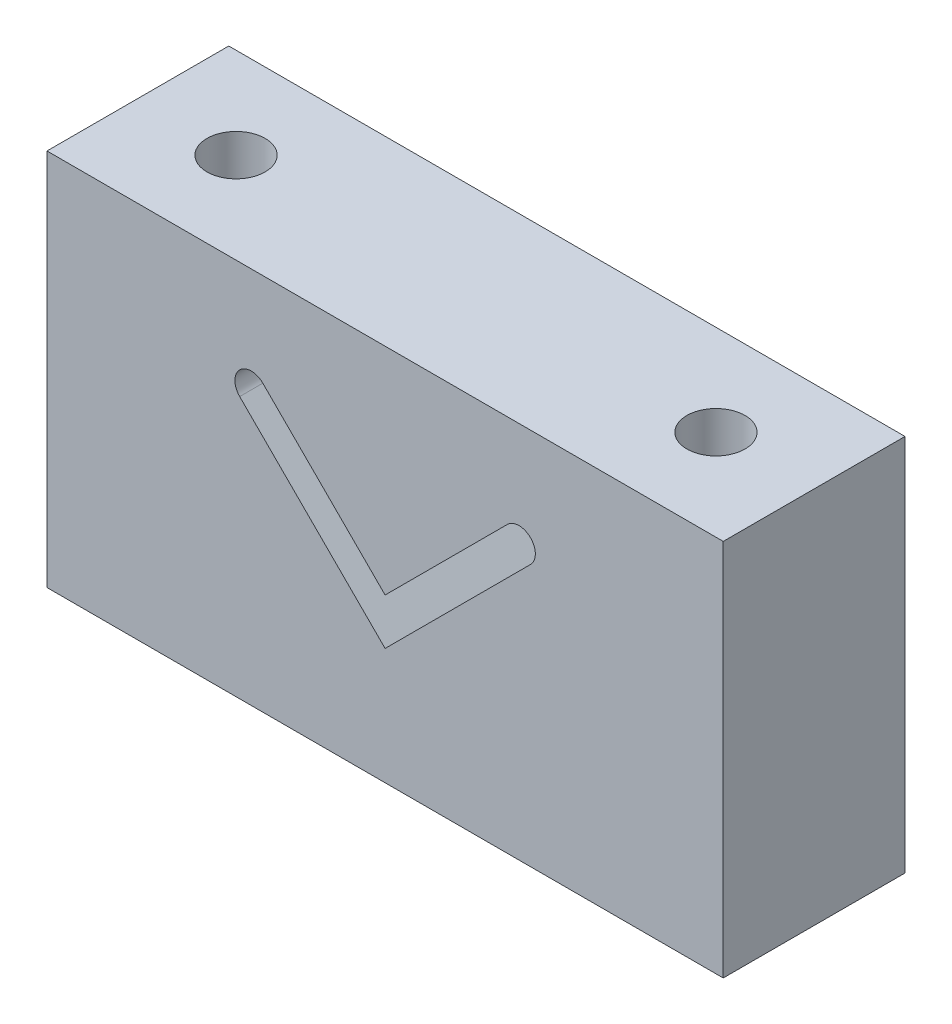
ISO-10303-21;
HEADER;
FILE_DESCRIPTION(('STEP AP214'),'2;1');
FILE_NAME('part.step','',(''),(''),'','','');
FILE_SCHEMA(('AUTOMOTIVE_DESIGN { 1 0 10303 214 1 1 1 1 }'));
ENDSEC;
DATA;
#1=APPLICATION_CONTEXT('core data for automotive mechanical design processes');
#2=APPLICATION_PROTOCOL_DEFINITION('international standard','automotive_design',2000,#1);
#3=PRODUCT_CONTEXT('',#1,'mechanical');
#4=PRODUCT('Part','Part','',(#3));
#5=PRODUCT_RELATED_PRODUCT_CATEGORY('part','',(#4));
#6=PRODUCT_DEFINITION_FORMATION('','',#4);
#7=PRODUCT_DEFINITION_CONTEXT('part definition',#1,'design');
#8=PRODUCT_DEFINITION('design','',#6,#7);
#9=PRODUCT_DEFINITION_SHAPE('','',#8);
#10=(LENGTH_UNIT() NAMED_UNIT(*) SI_UNIT(.MILLI.,.METRE.));
#11=(NAMED_UNIT(*) PLANE_ANGLE_UNIT() SI_UNIT($,.RADIAN.));
#12=(NAMED_UNIT(*) SI_UNIT($,.STERADIAN.) SOLID_ANGLE_UNIT());
#13=UNCERTAINTY_MEASURE_WITH_UNIT(LENGTH_MEASURE(1.E-05),#10,'distance_accuracy_value','');
#14=(GEOMETRIC_REPRESENTATION_CONTEXT(3) GLOBAL_UNCERTAINTY_ASSIGNED_CONTEXT((#13)) GLOBAL_UNIT_ASSIGNED_CONTEXT((#10,
#11,#12)) REPRESENTATION_CONTEXT('',''));
#15=CARTESIAN_POINT('',(0.,0.,0.));
#16=DIRECTION('',(0.,0.,1.));
#17=DIRECTION('',(1.,0.,0.));
#18=AXIS2_PLACEMENT_3D('',#15,#16,#17);
#19=CARTESIAN_POINT('',(-46.5,-26.,25.));
#20=DIRECTION('',(1.,0.,0.));
#21=DIRECTION('',(0.,0.,-1.));
#22=AXIS2_PLACEMENT_3D('',#19,#20,#21);
#23=PLANE('',#22);
#24=DIRECTION('',(0.,-1.,0.));
#25=VECTOR('',#24,1.);
#26=CARTESIAN_POINT('',(-46.5,-26.,0.));
#27=LINE('',#26,#25);
#28=CARTESIAN_POINT('',(-46.5,26.,0.));
#29=VERTEX_POINT('',#28);
#30=CARTESIAN_POINT('',(-46.5,-26.,0.));
#31=VERTEX_POINT('',#30);
#32=EDGE_CURVE('E158',#29,#31,#27,.T.);
#33=ORIENTED_EDGE('',*,*,#32,.T.);
#34=DIRECTION('',(0.,0.,-1.));
#35=VECTOR('',#34,1.);
#36=CARTESIAN_POINT('',(-46.5,-26.,25.));
#37=LINE('',#36,#35);
#38=CARTESIAN_POINT('',(-46.5,-26.,25.));
#39=VERTEX_POINT('',#38);
#40=EDGE_CURVE('E11',#39,#31,#37,.T.);
#41=ORIENTED_EDGE('',*,*,#40,.F.);
#42=DIRECTION('',(0.,-1.,0.));
#43=VECTOR('',#42,1.);
#44=CARTESIAN_POINT('',(-46.5,-26.,25.));
#45=LINE('',#44,#43);
#46=CARTESIAN_POINT('',(-46.5,26.,25.));
#47=VERTEX_POINT('',#46);
#48=EDGE_CURVE('E166',#47,#39,#45,.T.);
#49=ORIENTED_EDGE('',*,*,#48,.F.);
#50=DIRECTION('',(0.,0.,-1.));
#51=VECTOR('',#50,1.);
#52=CARTESIAN_POINT('',(-46.5,26.,25.));
#53=LINE('',#52,#51);
#54=EDGE_CURVE('E176',#47,#29,#53,.T.);
#55=ORIENTED_EDGE('',*,*,#54,.T.);
#56=EDGE_LOOP('',(#33,#41,#49,#55));
#57=FACE_BOUND('',#56,.T.);
#58=ADVANCED_FACE('F33',(#57),#23,.F.);
#59=CARTESIAN_POINT('',(46.5,-26.,25.));
#60=DIRECTION('',(0.,1.,0.));
#61=DIRECTION('',(-1.,0.,0.));
#62=AXIS2_PLACEMENT_3D('',#59,#60,#61);
#63=PLANE('',#62);
#64=CARTESIAN_POINT('',(-33.,-26.,12.5));
#65=DIRECTION('',(0.,-1.,0.));
#66=DIRECTION('',(1.,0.,0.));
#67=AXIS2_PLACEMENT_3D('',#64,#65,#66);
#68=CIRCLE('',#67,4.);
#69=CARTESIAN_POINT('',(-29.,-26.,12.5));
#70=VERTEX_POINT('',#69);
#71=EDGE_CURVE('E258',#70,#70,#68,.T.);
#72=ORIENTED_EDGE('',*,*,#71,.F.);
#73=EDGE_LOOP('',(#72));
#74=FACE_BOUND('',#73,.T.);
#75=CARTESIAN_POINT('',(33.,-26.,12.5));
#76=DIRECTION('',(0.,-1.,0.));
#77=DIRECTION('',(-1.,0.,0.));
#78=AXIS2_PLACEMENT_3D('',#75,#76,#77);
#79=CIRCLE('',#78,4.);
#80=CARTESIAN_POINT('',(29.,-26.,12.5));
#81=VERTEX_POINT('',#80);
#82=EDGE_CURVE('E134',#81,#81,#79,.T.);
#83=ORIENTED_EDGE('',*,*,#82,.F.);
#84=EDGE_LOOP('',(#83));
#85=FACE_BOUND('',#84,.T.);
#86=DIRECTION('',(1.,0.,0.));
#87=VECTOR('',#86,1.);
#88=CARTESIAN_POINT('',(46.5,-26.,0.));
#89=LINE('',#88,#87);
#90=CARTESIAN_POINT('',(46.5,-26.,0.));
#91=VERTEX_POINT('',#90);
#92=EDGE_CURVE('E179',#31,#91,#89,.T.);
#93=ORIENTED_EDGE('',*,*,#92,.T.);
#94=DIRECTION('',(0.,0.,-1.));
#95=VECTOR('',#94,1.);
#96=CARTESIAN_POINT('',(46.5,-26.,25.));
#97=LINE('',#96,#95);
#98=CARTESIAN_POINT('',(46.5,-26.,25.));
#99=VERTEX_POINT('',#98);
#100=EDGE_CURVE('E40',#99,#91,#97,.T.);
#101=ORIENTED_EDGE('',*,*,#100,.F.);
#102=DIRECTION('',(1.,0.,0.));
#103=VECTOR('',#102,1.);
#104=CARTESIAN_POINT('',(46.5,-26.,25.));
#105=LINE('',#104,#103);
#106=EDGE_CURVE('E169',#39,#99,#105,.T.);
#107=ORIENTED_EDGE('',*,*,#106,.F.);
#108=ORIENTED_EDGE('',*,*,#40,.T.);
#109=EDGE_LOOP('',(#93,#101,#107,#108));
#110=FACE_BOUND('',#109,.T.);
#111=ADVANCED_FACE('F207',(#74,#85,#110),#63,.F.);
#112=CARTESIAN_POINT('',(46.5,-26.,25.));
#113=DIRECTION('',(-1.,0.,0.));
#114=DIRECTION('',(0.,0.,1.));
#115=AXIS2_PLACEMENT_3D('',#112,#113,#114);
#116=PLANE('',#115);
#117=DIRECTION('',(0.,1.,0.));
#118=VECTOR('',#117,1.);
#119=CARTESIAN_POINT('',(46.5,-26.,0.));
#120=LINE('',#119,#118);
#121=CARTESIAN_POINT('',(46.5,26.,0.));
#122=VERTEX_POINT('',#121);
#123=EDGE_CURVE('E181',#91,#122,#120,.T.);
#124=ORIENTED_EDGE('',*,*,#123,.T.);
#125=DIRECTION('',(0.,0.,-1.));
#126=VECTOR('',#125,1.);
#127=CARTESIAN_POINT('',(46.5,26.,25.));
#128=LINE('',#127,#126);
#129=CARTESIAN_POINT('',(46.5,26.,25.));
#130=VERTEX_POINT('',#129);
#131=EDGE_CURVE('E186',#130,#122,#128,.T.);
#132=ORIENTED_EDGE('',*,*,#131,.F.);
#133=DIRECTION('',(0.,1.,0.));
#134=VECTOR('',#133,1.);
#135=CARTESIAN_POINT('',(46.5,-26.,25.));
#136=LINE('',#135,#134);
#137=EDGE_CURVE('E172',#99,#130,#136,.T.);
#138=ORIENTED_EDGE('',*,*,#137,.F.);
#139=ORIENTED_EDGE('',*,*,#100,.T.);
#140=EDGE_LOOP('',(#124,#132,#138,#139));
#141=FACE_BOUND('',#140,.T.);
#142=ADVANCED_FACE('F193',(#141),#116,.F.);
#143=CARTESIAN_POINT('',(46.5,26.,25.));
#144=DIRECTION('',(0.,-1.,0.));
#145=DIRECTION('',(1.,0.,0.));
#146=AXIS2_PLACEMENT_3D('',#143,#144,#145);
#147=PLANE('',#146);
#148=CARTESIAN_POINT('',(-33.,26.,12.5));
#149=DIRECTION('',(0.,-1.,0.));
#150=DIRECTION('',(1.,0.,0.));
#151=AXIS2_PLACEMENT_3D('',#148,#149,#150);
#152=CIRCLE('',#151,4.);
#153=CARTESIAN_POINT('',(-29.,26.,12.5));
#154=VERTEX_POINT('',#153);
#155=EDGE_CURVE('E146',#154,#154,#152,.T.);
#156=ORIENTED_EDGE('',*,*,#155,.T.);
#157=EDGE_LOOP('',(#156));
#158=FACE_BOUND('',#157,.T.);
#159=CARTESIAN_POINT('',(33.,26.,12.5));
#160=DIRECTION('',(0.,-1.,0.));
#161=DIRECTION('',(-1.,0.,0.));
#162=AXIS2_PLACEMENT_3D('',#159,#160,#161);
#163=CIRCLE('',#162,4.);
#164=CARTESIAN_POINT('',(29.,26.,12.5));
#165=VERTEX_POINT('',#164);
#166=EDGE_CURVE('E259',#165,#165,#163,.T.);
#167=ORIENTED_EDGE('',*,*,#166,.T.);
#168=EDGE_LOOP('',(#167));
#169=FACE_BOUND('',#168,.T.);
#170=DIRECTION('',(-1.,0.,0.));
#171=VECTOR('',#170,1.);
#172=CARTESIAN_POINT('',(46.5,26.,0.));
#173=LINE('',#172,#171);
#174=EDGE_CURVE('E170',#122,#29,#173,.T.);
#175=ORIENTED_EDGE('',*,*,#174,.T.);
#176=ORIENTED_EDGE('',*,*,#54,.F.);
#177=DIRECTION('',(-1.,0.,0.));
#178=VECTOR('',#177,1.);
#179=CARTESIAN_POINT('',(46.5,26.,25.));
#180=LINE('',#179,#178);
#181=EDGE_CURVE('E174',#130,#47,#180,.T.);
#182=ORIENTED_EDGE('',*,*,#181,.F.);
#183=ORIENTED_EDGE('',*,*,#131,.T.);
#184=EDGE_LOOP('',(#175,#176,#182,#183));
#185=FACE_BOUND('',#184,.T.);
#186=ADVANCED_FACE('F202',(#158,#169,#185),#147,.F.);
#187=CARTESIAN_POINT('',(0.,0.,25.));
#188=DIRECTION('',(0.,0.,1.));
#189=DIRECTION('',(1.,0.,0.));
#190=AXIS2_PLACEMENT_3D('',#187,#188,#189);
#191=PLANE('',#190);
#192=DIRECTION('',(-0.707106781186387,-0.707106781186708,0.));
#193=VECTOR('',#192,1.);
#194=CARTESIAN_POINT('',(0.,-10.,25.));
#195=LINE('',#194,#193);
#196=CARTESIAN_POINT('',(19.9999999999909,10.,25.));
#197=VERTEX_POINT('',#196);
#198=CARTESIAN_POINT('',(0.,-10.,25.));
#199=VERTEX_POINT('',#198);
#200=EDGE_CURVE('E111',#197,#199,#195,.T.);
#201=ORIENTED_EDGE('',*,*,#200,.T.);
#202=DIRECTION('',(-0.707106781186387,0.707106781186708,0.));
#203=VECTOR('',#202,1.);
#204=CARTESIAN_POINT('',(0.,-10.,25.));
#205=LINE('',#204,#203);
#206=CARTESIAN_POINT('',(-19.9999999999909,10.,25.));
#207=VERTEX_POINT('',#206);
#208=EDGE_CURVE('E120',#199,#207,#205,.T.);
#209=ORIENTED_EDGE('',*,*,#208,.T.);
#210=CARTESIAN_POINT('',(-18.4090097423234,11.5909902576675,25.));
#211=DIRECTION('',(0.,0.,-1.));
#212=DIRECTION('',(-1.,0.,0.));
#213=AXIS2_PLACEMENT_3D('',#210,#211,#212);
#214=CIRCLE('',#213,2.24999999999678);
#215=CARTESIAN_POINT('',(-16.818019484656,13.1819805153349,25.));
#216=VERTEX_POINT('',#215);
#217=EDGE_CURVE('E47',#207,#216,#214,.T.);
#218=ORIENTED_EDGE('',*,*,#217,.T.);
#219=DIRECTION('',(0.707106781186548,-0.707106781186548,0.));
#220=VECTOR('',#219,1.);
#221=CARTESIAN_POINT('',(0.,-3.63603896932107,25.));
#222=LINE('',#221,#220);
#223=CARTESIAN_POINT('',(0.,-3.63603896932107,25.));
#224=VERTEX_POINT('',#223);
#225=EDGE_CURVE('E138',#216,#224,#222,.T.);
#226=ORIENTED_EDGE('',*,*,#225,.T.);
#227=DIRECTION('',(0.707106781186548,0.707106781186548,0.));
#228=VECTOR('',#227,1.);
#229=CARTESIAN_POINT('',(0.,-3.63603896932107,25.));
#230=LINE('',#229,#228);
#231=CARTESIAN_POINT('',(16.818019484656,13.1819805153349,25.));
#232=VERTEX_POINT('',#231);
#233=EDGE_CURVE('E141',#224,#232,#230,.T.);
#234=ORIENTED_EDGE('',*,*,#233,.T.);
#235=CARTESIAN_POINT('',(18.4090097423234,11.5909902576675,25.));
#236=DIRECTION('',(0.,0.,-1.));
#237=DIRECTION('',(1.,0.,0.));
#238=AXIS2_PLACEMENT_3D('',#235,#236,#237);
#239=CIRCLE('',#238,2.24999999999678);
#240=EDGE_CURVE('E117',#232,#197,#239,.T.);
#241=ORIENTED_EDGE('',*,*,#240,.T.);
#242=EDGE_LOOP('',(#201,#209,#218,#226,#234,#241));
#243=FACE_BOUND('',#242,.T.);
#244=ORIENTED_EDGE('',*,*,#48,.T.);
#245=ORIENTED_EDGE('',*,*,#106,.T.);
#246=ORIENTED_EDGE('',*,*,#137,.T.);
#247=ORIENTED_EDGE('',*,*,#181,.T.);
#248=EDGE_LOOP('',(#244,#245,#246,#247));
#249=FACE_BOUND('',#248,.T.);
#250=ADVANCED_FACE('F124',(#243,#249),#191,.T.);
#251=CARTESIAN_POINT('',(0.,0.,0.));
#252=DIRECTION('',(0.,0.,1.));
#253=DIRECTION('',(1.,0.,0.));
#254=AXIS2_PLACEMENT_3D('',#251,#252,#253);
#255=PLANE('',#254);
#256=DIRECTION('',(-0.707106781186387,0.707106781186708,0.));
#257=VECTOR('',#256,1.);
#258=CARTESIAN_POINT('',(0.,-10.,0.));
#259=LINE('',#258,#257);
#260=CARTESIAN_POINT('',(0.,-10.,0.));
#261=VERTEX_POINT('',#260);
#262=CARTESIAN_POINT('',(-19.9999999999909,10.,0.));
#263=VERTEX_POINT('',#262);
#264=EDGE_CURVE('E145',#261,#263,#259,.T.);
#265=ORIENTED_EDGE('',*,*,#264,.F.);
#266=DIRECTION('',(-0.707106781186387,-0.707106781186708,0.));
#267=VECTOR('',#266,1.);
#268=CARTESIAN_POINT('',(0.,-10.,0.));
#269=LINE('',#268,#267);
#270=CARTESIAN_POINT('',(19.9999999999909,10.,0.));
#271=VERTEX_POINT('',#270);
#272=EDGE_CURVE('E55',#271,#261,#269,.T.);
#273=ORIENTED_EDGE('',*,*,#272,.F.);
#274=CARTESIAN_POINT('',(18.4090097423234,11.5909902576675,0.));
#275=DIRECTION('',(0.,0.,-1.));
#276=DIRECTION('',(1.,0.,0.));
#277=AXIS2_PLACEMENT_3D('',#274,#275,#276);
#278=CIRCLE('',#277,2.24999999999678);
#279=CARTESIAN_POINT('',(16.818019484656,13.1819805153349,0.));
#280=VERTEX_POINT('',#279);
#281=EDGE_CURVE('E128',#280,#271,#278,.T.);
#282=ORIENTED_EDGE('',*,*,#281,.F.);
#283=DIRECTION('',(0.707106781186548,0.707106781186548,0.));
#284=VECTOR('',#283,1.);
#285=CARTESIAN_POINT('',(0.,-3.63603896932107,0.));
#286=LINE('',#285,#284);
#287=CARTESIAN_POINT('',(0.,-3.63603896932107,0.));
#288=VERTEX_POINT('',#287);
#289=EDGE_CURVE('E131',#288,#280,#286,.T.);
#290=ORIENTED_EDGE('',*,*,#289,.F.);
#291=DIRECTION('',(0.707106781186548,-0.707106781186548,0.));
#292=VECTOR('',#291,1.);
#293=CARTESIAN_POINT('',(0.,-3.63603896932107,0.));
#294=LINE('',#293,#292);
#295=CARTESIAN_POINT('',(-16.818019484656,13.1819805153349,0.));
#296=VERTEX_POINT('',#295);
#297=EDGE_CURVE('E151',#296,#288,#294,.T.);
#298=ORIENTED_EDGE('',*,*,#297,.F.);
#299=CARTESIAN_POINT('',(-18.4090097423234,11.5909902576675,0.));
#300=DIRECTION('',(0.,0.,-1.));
#301=DIRECTION('',(-1.,0.,0.));
#302=AXIS2_PLACEMENT_3D('',#299,#300,#301);
#303=CIRCLE('',#302,2.24999999999678);
#304=EDGE_CURVE('E148',#263,#296,#303,.T.);
#305=ORIENTED_EDGE('',*,*,#304,.F.);
#306=EDGE_LOOP('',(#265,#273,#282,#290,#298,#305));
#307=FACE_BOUND('',#306,.T.);
#308=ORIENTED_EDGE('',*,*,#32,.F.);
#309=ORIENTED_EDGE('',*,*,#174,.F.);
#310=ORIENTED_EDGE('',*,*,#123,.F.);
#311=ORIENTED_EDGE('',*,*,#92,.F.);
#312=EDGE_LOOP('',(#308,#309,#310,#311));
#313=FACE_BOUND('',#312,.T.);
#314=ADVANCED_FACE('F199',(#307,#313),#255,.F.);
#315=CARTESIAN_POINT('',(0.,-10.,25.));
#316=DIRECTION('',(0.707106781186708,-0.707106781186387,0.));
#317=DIRECTION('',(0.707106781186387,0.707106781186708,0.));
#318=AXIS2_PLACEMENT_3D('',#315,#316,#317);
#319=PLANE('',#318);
#320=ORIENTED_EDGE('',*,*,#272,.T.);
#321=DIRECTION('',(0.,0.,-1.));
#322=VECTOR('',#321,1.);
#323=CARTESIAN_POINT('',(0.,-10.,25.));
#324=LINE('',#323,#322);
#325=EDGE_CURVE('E107',#199,#261,#324,.T.);
#326=ORIENTED_EDGE('',*,*,#325,.F.);
#327=ORIENTED_EDGE('',*,*,#200,.F.);
#328=DIRECTION('',(0.,0.,-1.));
#329=VECTOR('',#328,1.);
#330=CARTESIAN_POINT('',(19.9999999999909,10.,25.));
#331=LINE('',#330,#329);
#332=EDGE_CURVE('E156',#197,#271,#331,.T.);
#333=ORIENTED_EDGE('',*,*,#332,.T.);
#334=EDGE_LOOP('',(#320,#326,#327,#333));
#335=FACE_BOUND('',#334,.T.);
#336=ADVANCED_FACE('F109',(#335),#319,.F.);
#337=CARTESIAN_POINT('',(18.4090097423234,11.5909902576675,25.));
#338=DIRECTION('',(0.,0.,-1.));
#339=DIRECTION('',(-1.,0.,0.));
#340=AXIS2_PLACEMENT_3D('',#337,#338,#339);
#341=CYLINDRICAL_SURFACE('',#340,2.24999999999678);
#342=ORIENTED_EDGE('',*,*,#281,.T.);
#343=ORIENTED_EDGE('',*,*,#332,.F.);
#344=ORIENTED_EDGE('',*,*,#240,.F.);
#345=DIRECTION('',(0.,0.,-1.));
#346=VECTOR('',#345,1.);
#347=CARTESIAN_POINT('',(16.818019484656,13.1819805153349,25.));
#348=LINE('',#347,#346);
#349=EDGE_CURVE('E159',#232,#280,#348,.T.);
#350=ORIENTED_EDGE('',*,*,#349,.T.);
#351=EDGE_LOOP('',(#342,#343,#344,#350));
#352=FACE_BOUND('',#351,.T.);
#353=ADVANCED_FACE('F228',(#352),#341,.F.);
#354=CARTESIAN_POINT('',(0.,-3.63603896932107,25.));
#355=DIRECTION('',(-0.707106781186548,0.707106781186548,0.));
#356=DIRECTION('',(-0.707106781186548,-0.707106781186548,0.));
#357=AXIS2_PLACEMENT_3D('',#354,#355,#356);
#358=PLANE('',#357);
#359=ORIENTED_EDGE('',*,*,#289,.T.);
#360=ORIENTED_EDGE('',*,*,#349,.F.);
#361=ORIENTED_EDGE('',*,*,#233,.F.);
#362=DIRECTION('',(0.,0.,-1.));
#363=VECTOR('',#362,1.);
#364=CARTESIAN_POINT('',(0.,-3.63603896932107,25.));
#365=LINE('',#364,#363);
#366=EDGE_CURVE('E161',#224,#288,#365,.T.);
#367=ORIENTED_EDGE('',*,*,#366,.T.);
#368=EDGE_LOOP('',(#359,#360,#361,#367));
#369=FACE_BOUND('',#368,.T.);
#370=ADVANCED_FACE('F238',(#369),#358,.F.);
#371=CARTESIAN_POINT('',(0.,-3.63603896932107,25.));
#372=DIRECTION('',(0.707106781186548,0.707106781186548,0.));
#373=DIRECTION('',(-0.707106781186548,0.707106781186548,0.));
#374=AXIS2_PLACEMENT_3D('',#371,#372,#373);
#375=PLANE('',#374);
#376=ORIENTED_EDGE('',*,*,#297,.T.);
#377=ORIENTED_EDGE('',*,*,#366,.F.);
#378=ORIENTED_EDGE('',*,*,#225,.F.);
#379=DIRECTION('',(0.,0.,-1.));
#380=VECTOR('',#379,1.);
#381=CARTESIAN_POINT('',(-16.818019484656,13.1819805153349,25.));
#382=LINE('',#381,#380);
#383=EDGE_CURVE('E163',#216,#296,#382,.T.);
#384=ORIENTED_EDGE('',*,*,#383,.T.);
#385=EDGE_LOOP('',(#376,#377,#378,#384));
#386=FACE_BOUND('',#385,.T.);
#387=ADVANCED_FACE('F235',(#386),#375,.F.);
#388=CARTESIAN_POINT('',(-18.4090097423234,11.5909902576675,25.));
#389=DIRECTION('',(0.,0.,-1.));
#390=DIRECTION('',(-1.,0.,0.));
#391=AXIS2_PLACEMENT_3D('',#388,#389,#390);
#392=CYLINDRICAL_SURFACE('',#391,2.24999999999678);
#393=ORIENTED_EDGE('',*,*,#304,.T.);
#394=ORIENTED_EDGE('',*,*,#383,.F.);
#395=ORIENTED_EDGE('',*,*,#217,.F.);
#396=DIRECTION('',(0.,0.,-1.));
#397=VECTOR('',#396,1.);
#398=CARTESIAN_POINT('',(-19.9999999999909,10.,25.));
#399=LINE('',#398,#397);
#400=EDGE_CURVE('E116',#207,#263,#399,.T.);
#401=ORIENTED_EDGE('',*,*,#400,.T.);
#402=EDGE_LOOP('',(#393,#394,#395,#401));
#403=FACE_BOUND('',#402,.T.);
#404=ADVANCED_FACE('F232',(#403),#392,.F.);
#405=CARTESIAN_POINT('',(0.,-10.,25.));
#406=DIRECTION('',(-0.707106781186708,-0.707106781186387,0.));
#407=DIRECTION('',(0.707106781186387,-0.707106781186708,0.));
#408=AXIS2_PLACEMENT_3D('',#405,#406,#407);
#409=PLANE('',#408);
#410=ORIENTED_EDGE('',*,*,#264,.T.);
#411=ORIENTED_EDGE('',*,*,#400,.F.);
#412=ORIENTED_EDGE('',*,*,#208,.F.);
#413=ORIENTED_EDGE('',*,*,#325,.T.);
#414=EDGE_LOOP('',(#410,#411,#412,#413));
#415=FACE_BOUND('',#414,.T.);
#416=ADVANCED_FACE('F121',(#415),#409,.F.);
#417=CARTESIAN_POINT('',(33.,26.,12.5));
#418=DIRECTION('',(0.,-1.,0.));
#419=DIRECTION('',(1.,0.,0.));
#420=AXIS2_PLACEMENT_3D('',#417,#418,#419);
#421=CYLINDRICAL_SURFACE('',#420,4.);
#422=ORIENTED_EDGE('',*,*,#166,.F.);
#423=EDGE_LOOP('',(#422));
#424=FACE_BOUND('',#423,.T.);
#425=ORIENTED_EDGE('',*,*,#82,.T.);
#426=EDGE_LOOP('',(#425));
#427=FACE_BOUND('',#426,.T.);
#428=ADVANCED_FACE('F231',(#424,#427),#421,.F.);
#429=CARTESIAN_POINT('',(-33.,26.,12.5));
#430=DIRECTION('',(0.,-1.,0.));
#431=DIRECTION('',(1.,0.,0.));
#432=AXIS2_PLACEMENT_3D('',#429,#430,#431);
#433=CYLINDRICAL_SURFACE('',#432,4.);
#434=ORIENTED_EDGE('',*,*,#155,.F.);
#435=EDGE_LOOP('',(#434));
#436=FACE_BOUND('',#435,.T.);
#437=ORIENTED_EDGE('',*,*,#71,.T.);
#438=EDGE_LOOP('',(#437));
#439=FACE_BOUND('',#438,.T.);
#440=ADVANCED_FACE('F248',(#436,#439),#433,.F.);
#441=CLOSED_SHELL('',(#58,#111,#142,#186,#250,#314,#336,#353,#370,#387,#404,#416,#428,#440));
#442=MANIFOLD_SOLID_BREP('B2',#441);
#443=ADVANCED_BREP_SHAPE_REPRESENTATION('',(#18,#442),#14);
#444=SHAPE_DEFINITION_REPRESENTATION(#9,#443);
ENDSEC;
END-ISO-10303-21;
